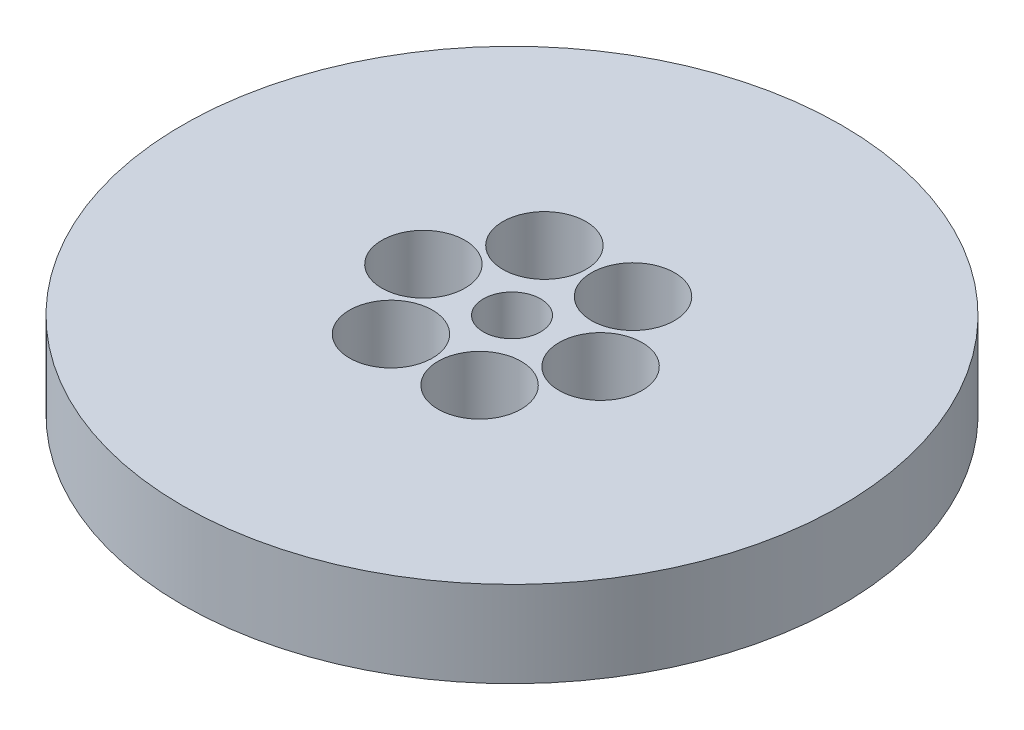
ISO-10303-21;
HEADER;
FILE_DESCRIPTION(('STEP AP214'),'2;1');
FILE_NAME('part.step','',(''),(''),'','','');
FILE_SCHEMA(('AUTOMOTIVE_DESIGN { 1 0 10303 214 1 1 1 1 }'));
ENDSEC;
DATA;
#1=APPLICATION_CONTEXT('core data for automotive mechanical design processes');
#2=APPLICATION_PROTOCOL_DEFINITION('international standard','automotive_design',2000,#1);
#3=PRODUCT_CONTEXT('',#1,'mechanical');
#4=PRODUCT('Part','Part','',(#3));
#5=PRODUCT_RELATED_PRODUCT_CATEGORY('part','',(#4));
#6=PRODUCT_DEFINITION_FORMATION('','',#4);
#7=PRODUCT_DEFINITION_CONTEXT('part definition',#1,'design');
#8=PRODUCT_DEFINITION('design','',#6,#7);
#9=PRODUCT_DEFINITION_SHAPE('','',#8);
#10=(LENGTH_UNIT() NAMED_UNIT(*) SI_UNIT(.MILLI.,.METRE.));
#11=(NAMED_UNIT(*) PLANE_ANGLE_UNIT() SI_UNIT($,.RADIAN.));
#12=(NAMED_UNIT(*) SI_UNIT($,.STERADIAN.) SOLID_ANGLE_UNIT());
#13=UNCERTAINTY_MEASURE_WITH_UNIT(LENGTH_MEASURE(1.E-05),#10,'distance_accuracy_value','');
#14=(GEOMETRIC_REPRESENTATION_CONTEXT(3) GLOBAL_UNCERTAINTY_ASSIGNED_CONTEXT((#13)) GLOBAL_UNIT_ASSIGNED_CONTEXT((#10,
#11,#12)) REPRESENTATION_CONTEXT('',''));
#15=CARTESIAN_POINT('',(0.,0.,0.));
#16=DIRECTION('',(0.,0.,1.));
#17=DIRECTION('',(1.,0.,0.));
#18=AXIS2_PLACEMENT_3D('',#15,#16,#17);
#19=CARTESIAN_POINT('',(0.,15.,0.));
#20=DIRECTION('',(0.,-1.,0.));
#21=DIRECTION('',(0.,0.,-1.));
#22=AXIS2_PLACEMENT_3D('',#19,#20,#21);
#23=CYLINDRICAL_SURFACE('',#22,57.5);
#24=CARTESIAN_POINT('',(0.,15.,0.));
#25=DIRECTION('',(0.,1.,0.));
#26=DIRECTION('',(0.,0.,1.));
#27=AXIS2_PLACEMENT_3D('',#24,#25,#26);
#28=CIRCLE('',#27,57.5);
#29=CARTESIAN_POINT('',(0.,15.,57.5));
#30=VERTEX_POINT('',#29);
#31=EDGE_CURVE('E10',#30,#30,#28,.T.);
#32=ORIENTED_EDGE('',*,*,#31,.F.);
#33=EDGE_LOOP('',(#32));
#34=FACE_BOUND('',#33,.T.);
#35=CARTESIAN_POINT('',(0.,0.,0.));
#36=DIRECTION('',(0.,1.,0.));
#37=DIRECTION('',(0.,0.,1.));
#38=AXIS2_PLACEMENT_3D('',#35,#36,#37);
#39=CIRCLE('',#38,57.5);
#40=CARTESIAN_POINT('',(0.,0.,57.5));
#41=VERTEX_POINT('',#40);
#42=EDGE_CURVE('E37',#41,#41,#39,.T.);
#43=ORIENTED_EDGE('',*,*,#42,.T.);
#44=EDGE_LOOP('',(#43));
#45=FACE_BOUND('',#44,.T.);
#46=ADVANCED_FACE('F40',(#34,#45),#23,.T.);
#47=CARTESIAN_POINT('',(0.,15.,0.));
#48=DIRECTION('',(0.,1.,0.));
#49=DIRECTION('',(0.,0.,1.));
#50=AXIS2_PLACEMENT_3D('',#47,#48,#49);
#51=PLANE('',#50);
#52=CARTESIAN_POINT('',(15.4574735331729,15.,0.));
#53=DIRECTION('',(0.,1.,0.));
#54=DIRECTION('',(0.,0.,-1.));
#55=AXIS2_PLACEMENT_3D('',#52,#53,#54);
#56=CIRCLE('',#55,7.24816447652533);
#57=CARTESIAN_POINT('',(15.4574735331729,15.,-7.24816447652533));
#58=VERTEX_POINT('',#57);
#59=EDGE_CURVE('E71',#58,#58,#56,.T.);
#60=ORIENTED_EDGE('',*,*,#59,.F.);
#61=EDGE_LOOP('',(#60));
#62=FACE_BOUND('',#61,.T.);
#63=CARTESIAN_POINT('',(7.72873676658653,15.,13.3865647580533));
#64=DIRECTION('',(0.,1.,0.));
#65=DIRECTION('',(0.866025403784436,0.,-0.500000000000004));
#66=AXIS2_PLACEMENT_3D('',#63,#64,#65);
#67=CIRCLE('',#66,7.24816447652533);
#68=CARTESIAN_POINT('',(14.0058313340654,15.,9.76248251979063));
#69=VERTEX_POINT('',#68);
#70=EDGE_CURVE('E70',#69,#69,#67,.T.);
#71=ORIENTED_EDGE('',*,*,#70,.F.);
#72=EDGE_LOOP('',(#71));
#73=FACE_BOUND('',#72,.T.);
#74=CARTESIAN_POINT('',(7.72873676658634,15.,-13.3865647580534));
#75=DIRECTION('',(0.,1.,0.));
#76=DIRECTION('',(-0.866025403784443,0.,-0.499999999999992));
#77=AXIS2_PLACEMENT_3D('',#74,#75,#76);
#78=CIRCLE('',#77,7.24816447652533);
#79=CARTESIAN_POINT('',(1.45164219910743,15.,-17.010646996316));
#80=VERTEX_POINT('',#79);
#81=EDGE_CURVE('E84',#80,#80,#78,.T.);
#82=ORIENTED_EDGE('',*,*,#81,.F.);
#83=EDGE_LOOP('',(#82));
#84=FACE_BOUND('',#83,.T.);
#85=CARTESIAN_POINT('',(-7.72873676658662,15.,-13.3865647580533));
#86=DIRECTION('',(0.,1.,0.));
#87=DIRECTION('',(-0.866025403784433,0.,0.50000000000001));
#88=AXIS2_PLACEMENT_3D('',#85,#86,#87);
#89=CIRCLE('',#88,7.24816447652533);
#90=CARTESIAN_POINT('',(-14.0058313340655,15.,-9.76248251979053));
#91=VERTEX_POINT('',#90);
#92=EDGE_CURVE('E78',#91,#91,#89,.T.);
#93=ORIENTED_EDGE('',*,*,#92,.F.);
#94=EDGE_LOOP('',(#93));
#95=FACE_BOUND('',#94,.T.);
#96=CARTESIAN_POINT('',(-7.72873676658644,15.,13.3865647580534));
#97=DIRECTION('',(0.,1.,0.));
#98=DIRECTION('',(0.86602540378444,0.,0.499999999999998));
#99=AXIS2_PLACEMENT_3D('',#96,#97,#98);
#100=CIRCLE('',#99,7.24816447652533);
#101=CARTESIAN_POINT('',(-1.45164219910755,15.,17.010646996316));
#102=VERTEX_POINT('',#101);
#103=EDGE_CURVE('E61',#102,#102,#100,.T.);
#104=ORIENTED_EDGE('',*,*,#103,.F.);
#105=EDGE_LOOP('',(#104));
#106=FACE_BOUND('',#105,.T.);
#107=CARTESIAN_POINT('',(-15.4574735331729,15.,0.));
#108=DIRECTION('',(0.,1.,0.));
#109=DIRECTION('',(0.,0.,1.));
#110=AXIS2_PLACEMENT_3D('',#107,#108,#109);
#111=CIRCLE('',#110,7.24816447652533);
#112=CARTESIAN_POINT('',(-15.4574735331729,15.,7.24816447652533));
#113=VERTEX_POINT('',#112);
#114=EDGE_CURVE('E54',#113,#113,#111,.T.);
#115=ORIENTED_EDGE('',*,*,#114,.F.);
#116=EDGE_LOOP('',(#115));
#117=FACE_BOUND('',#116,.T.);
#118=CARTESIAN_POINT('',(0.,15.,0.));
#119=DIRECTION('',(0.,1.,0.));
#120=DIRECTION('',(0.,0.,1.));
#121=AXIS2_PLACEMENT_3D('',#118,#119,#120);
#122=CIRCLE('',#121,5.);
#123=CARTESIAN_POINT('',(0.,15.,5.));
#124=VERTEX_POINT('',#123);
#125=EDGE_CURVE('E50',#124,#124,#122,.T.);
#126=ORIENTED_EDGE('',*,*,#125,.F.);
#127=EDGE_LOOP('',(#126));
#128=FACE_BOUND('',#127,.T.);
#129=ORIENTED_EDGE('',*,*,#31,.T.);
#130=EDGE_LOOP('',(#129));
#131=FACE_BOUND('',#130,.T.);
#132=ADVANCED_FACE('F99',(#62,#73,#84,#95,#106,#117,#128,#131),#51,.T.);
#133=CARTESIAN_POINT('',(0.,0.,0.));
#134=DIRECTION('',(0.,1.,0.));
#135=DIRECTION('',(0.,0.,1.));
#136=AXIS2_PLACEMENT_3D('',#133,#134,#135);
#137=PLANE('',#136);
#138=CARTESIAN_POINT('',(0.,0.,0.));
#139=DIRECTION('',(0.,1.,0.));
#140=DIRECTION('',(0.,0.,1.));
#141=AXIS2_PLACEMENT_3D('',#138,#139,#140);
#142=CIRCLE('',#141,5.);
#143=CARTESIAN_POINT('',(0.,0.,5.));
#144=VERTEX_POINT('',#143);
#145=EDGE_CURVE('E47',#144,#144,#142,.T.);
#146=ORIENTED_EDGE('',*,*,#145,.T.);
#147=EDGE_LOOP('',(#146));
#148=FACE_BOUND('',#147,.T.);
#149=ORIENTED_EDGE('',*,*,#42,.F.);
#150=EDGE_LOOP('',(#149));
#151=FACE_BOUND('',#150,.T.);
#152=ADVANCED_FACE('F103',(#148,#151),#137,.F.);
#153=CARTESIAN_POINT('',(0.,15.,0.));
#154=DIRECTION('',(0.,-1.,0.));
#155=DIRECTION('',(0.,0.,-1.));
#156=AXIS2_PLACEMENT_3D('',#153,#154,#155);
#157=CYLINDRICAL_SURFACE('',#156,5.);
#158=ORIENTED_EDGE('',*,*,#125,.T.);
#159=EDGE_LOOP('',(#158));
#160=FACE_BOUND('',#159,.T.);
#161=ORIENTED_EDGE('',*,*,#145,.F.);
#162=EDGE_LOOP('',(#161));
#163=FACE_BOUND('',#162,.T.);
#164=ADVANCED_FACE('F111',(#160,#163),#157,.F.);
#165=CARTESIAN_POINT('',(-15.4574735331729,0.736676254707263,0.));
#166=DIRECTION('',(0.,1.,0.));
#167=DIRECTION('',(0.,0.,1.));
#168=AXIS2_PLACEMENT_3D('',#165,#166,#167);
#169=CYLINDRICAL_SURFACE('',#168,7.24816447652533);
#170=CARTESIAN_POINT('',(-15.4574735331729,0.736676254707263,0.));
#171=DIRECTION('',(0.,1.,0.));
#172=DIRECTION('',(0.,0.,1.));
#173=AXIS2_PLACEMENT_3D('',#170,#171,#172);
#174=CIRCLE('',#173,7.24816447652533);
#175=CARTESIAN_POINT('',(-15.4574735331729,0.736676254707263,7.24816447652533));
#176=VERTEX_POINT('',#175);
#177=EDGE_CURVE('E55',#176,#176,#174,.T.);
#178=ORIENTED_EDGE('',*,*,#177,.F.);
#179=EDGE_LOOP('',(#178));
#180=FACE_BOUND('',#179,.T.);
#181=ORIENTED_EDGE('',*,*,#114,.T.);
#182=EDGE_LOOP('',(#181));
#183=FACE_BOUND('',#182,.T.);
#184=ADVANCED_FACE('F120',(#180,#183),#169,.F.);
#185=CARTESIAN_POINT('',(-15.4574735331729,0.736676254707263,0.));
#186=DIRECTION('',(0.,1.,0.));
#187=DIRECTION('',(0.,0.,1.));
#188=AXIS2_PLACEMENT_3D('',#185,#186,#187);
#189=PLANE('',#188);
#190=ORIENTED_EDGE('',*,*,#177,.T.);
#191=EDGE_LOOP('',(#190));
#192=FACE_BOUND('',#191,.T.);
#193=ADVANCED_FACE('F150',(#192),#189,.T.);
#194=CARTESIAN_POINT('',(-7.72873676658644,0.736676254707263,13.3865647580534));
#195=DIRECTION('',(0.,1.,0.));
#196=DIRECTION('',(0.,0.,1.));
#197=AXIS2_PLACEMENT_3D('',#194,#195,#196);
#198=CYLINDRICAL_SURFACE('',#197,7.24816447652533);
#199=CARTESIAN_POINT('',(-7.72873676658644,0.736676254707263,13.3865647580534));
#200=DIRECTION('',(0.,1.,0.));
#201=DIRECTION('',(0.86602540378444,0.,0.499999999999998));
#202=AXIS2_PLACEMENT_3D('',#199,#200,#201);
#203=CIRCLE('',#202,7.24816447652533);
#204=CARTESIAN_POINT('',(-1.45164219910755,0.736676254707263,17.010646996316));
#205=VERTEX_POINT('',#204);
#206=EDGE_CURVE('E59',#205,#205,#203,.T.);
#207=ORIENTED_EDGE('',*,*,#206,.F.);
#208=EDGE_LOOP('',(#207));
#209=FACE_BOUND('',#208,.T.);
#210=ORIENTED_EDGE('',*,*,#103,.T.);
#211=EDGE_LOOP('',(#210));
#212=FACE_BOUND('',#211,.T.);
#213=ADVANCED_FACE('F154',(#209,#212),#198,.F.);
#214=CARTESIAN_POINT('',(-7.72873676658644,0.736676254707263,13.3865647580534));
#215=DIRECTION('',(0.,1.,0.));
#216=DIRECTION('',(0.86602540378444,0.,0.499999999999998));
#217=AXIS2_PLACEMENT_3D('',#214,#215,#216);
#218=PLANE('',#217);
#219=ORIENTED_EDGE('',*,*,#206,.T.);
#220=EDGE_LOOP('',(#219));
#221=FACE_BOUND('',#220,.T.);
#222=ADVANCED_FACE('F166',(#221),#218,.T.);
#223=CARTESIAN_POINT('',(-7.72873676658662,0.736676254707263,-13.3865647580533));
#224=DIRECTION('',(0.,1.,0.));
#225=DIRECTION('',(0.,0.,1.));
#226=AXIS2_PLACEMENT_3D('',#223,#224,#225);
#227=CYLINDRICAL_SURFACE('',#226,7.24816447652533);
#228=CARTESIAN_POINT('',(-7.72873676658662,0.736676254707263,-13.3865647580533));
#229=DIRECTION('',(0.,1.,0.));
#230=DIRECTION('',(-0.866025403784433,0.,0.50000000000001));
#231=AXIS2_PLACEMENT_3D('',#228,#229,#230);
#232=CIRCLE('',#231,7.24816447652533);
#233=CARTESIAN_POINT('',(-14.0058313340655,0.736676254707263,-9.76248251979053));
#234=VERTEX_POINT('',#233);
#235=EDGE_CURVE('E85',#234,#234,#232,.T.);
#236=ORIENTED_EDGE('',*,*,#235,.F.);
#237=EDGE_LOOP('',(#236));
#238=FACE_BOUND('',#237,.T.);
#239=ORIENTED_EDGE('',*,*,#92,.T.);
#240=EDGE_LOOP('',(#239));
#241=FACE_BOUND('',#240,.T.);
#242=ADVANCED_FACE('F177',(#238,#241),#227,.F.);
#243=CARTESIAN_POINT('',(-7.72873676658662,0.736676254707263,-13.3865647580533));
#244=DIRECTION('',(0.,1.,0.));
#245=DIRECTION('',(-0.866025403784433,0.,0.50000000000001));
#246=AXIS2_PLACEMENT_3D('',#243,#244,#245);
#247=PLANE('',#246);
#248=ORIENTED_EDGE('',*,*,#235,.T.);
#249=EDGE_LOOP('',(#248));
#250=FACE_BOUND('',#249,.T.);
#251=ADVANCED_FACE('F96',(#250),#247,.T.);
#252=CARTESIAN_POINT('',(7.72873676658634,0.736676254707263,-13.3865647580534));
#253=DIRECTION('',(0.,1.,0.));
#254=DIRECTION('',(0.,0.,1.));
#255=AXIS2_PLACEMENT_3D('',#252,#253,#254);
#256=CYLINDRICAL_SURFACE('',#255,7.24816447652533);
#257=CARTESIAN_POINT('',(7.72873676658634,0.736676254707263,-13.3865647580534));
#258=DIRECTION('',(0.,1.,0.));
#259=DIRECTION('',(-0.866025403784443,0.,-0.499999999999992));
#260=AXIS2_PLACEMENT_3D('',#257,#258,#259);
#261=CIRCLE('',#260,7.24816447652533);
#262=CARTESIAN_POINT('',(1.45164219910743,0.736676254707263,-17.010646996316));
#263=VERTEX_POINT('',#262);
#264=EDGE_CURVE('E76',#263,#263,#261,.T.);
#265=ORIENTED_EDGE('',*,*,#264,.F.);
#266=EDGE_LOOP('',(#265));
#267=FACE_BOUND('',#266,.T.);
#268=ORIENTED_EDGE('',*,*,#81,.T.);
#269=EDGE_LOOP('',(#268));
#270=FACE_BOUND('',#269,.T.);
#271=ADVANCED_FACE('F91',(#267,#270),#256,.F.);
#272=CARTESIAN_POINT('',(7.72873676658634,0.736676254707263,-13.3865647580534));
#273=DIRECTION('',(0.,1.,0.));
#274=DIRECTION('',(-0.866025403784443,0.,-0.499999999999992));
#275=AXIS2_PLACEMENT_3D('',#272,#273,#274);
#276=PLANE('',#275);
#277=ORIENTED_EDGE('',*,*,#264,.T.);
#278=EDGE_LOOP('',(#277));
#279=FACE_BOUND('',#278,.T.);
#280=ADVANCED_FACE('F93',(#279),#276,.T.);
#281=CARTESIAN_POINT('',(7.72873676658653,0.736676254707263,13.3865647580533));
#282=DIRECTION('',(0.,1.,0.));
#283=DIRECTION('',(0.,0.,1.));
#284=AXIS2_PLACEMENT_3D('',#281,#282,#283);
#285=CYLINDRICAL_SURFACE('',#284,7.24816447652533);
#286=CARTESIAN_POINT('',(7.72873676658653,0.736676254707263,13.3865647580533));
#287=DIRECTION('',(0.,1.,0.));
#288=DIRECTION('',(0.866025403784436,0.,-0.500000000000004));
#289=AXIS2_PLACEMENT_3D('',#286,#287,#288);
#290=CIRCLE('',#289,7.24816447652533);
#291=CARTESIAN_POINT('',(14.0058313340654,0.736676254707263,9.76248251979063));
#292=VERTEX_POINT('',#291);
#293=EDGE_CURVE('E63',#292,#292,#290,.T.);
#294=ORIENTED_EDGE('',*,*,#293,.F.);
#295=EDGE_LOOP('',(#294));
#296=FACE_BOUND('',#295,.T.);
#297=ORIENTED_EDGE('',*,*,#70,.T.);
#298=EDGE_LOOP('',(#297));
#299=FACE_BOUND('',#298,.T.);
#300=ADVANCED_FACE('F208',(#296,#299),#285,.F.);
#301=CARTESIAN_POINT('',(7.72873676658653,0.736676254707263,13.3865647580533));
#302=DIRECTION('',(0.,1.,0.));
#303=DIRECTION('',(0.866025403784436,0.,-0.500000000000004));
#304=AXIS2_PLACEMENT_3D('',#301,#302,#303);
#305=PLANE('',#304);
#306=ORIENTED_EDGE('',*,*,#293,.T.);
#307=EDGE_LOOP('',(#306));
#308=FACE_BOUND('',#307,.T.);
#309=ADVANCED_FACE('F216',(#308),#305,.T.);
#310=CARTESIAN_POINT('',(15.4574735331729,0.736676254707263,0.));
#311=DIRECTION('',(0.,1.,0.));
#312=DIRECTION('',(0.,0.,1.));
#313=AXIS2_PLACEMENT_3D('',#310,#311,#312);
#314=CYLINDRICAL_SURFACE('',#313,7.24816447652533);
#315=CARTESIAN_POINT('',(15.4574735331729,0.736676254707263,0.));
#316=DIRECTION('',(0.,1.,0.));
#317=DIRECTION('',(0.,0.,-1.));
#318=AXIS2_PLACEMENT_3D('',#315,#316,#317);
#319=CIRCLE('',#318,7.24816447652533);
#320=CARTESIAN_POINT('',(15.4574735331729,0.736676254707263,-7.24816447652533));
#321=VERTEX_POINT('',#320);
#322=EDGE_CURVE('E69',#321,#321,#319,.T.);
#323=ORIENTED_EDGE('',*,*,#322,.F.);
#324=EDGE_LOOP('',(#323));
#325=FACE_BOUND('',#324,.T.);
#326=ORIENTED_EDGE('',*,*,#59,.T.);
#327=EDGE_LOOP('',(#326));
#328=FACE_BOUND('',#327,.T.);
#329=ADVANCED_FACE('F223',(#325,#328),#314,.F.);
#330=CARTESIAN_POINT('',(15.4574735331729,0.736676254707263,0.));
#331=DIRECTION('',(0.,1.,0.));
#332=DIRECTION('',(0.,0.,-1.));
#333=AXIS2_PLACEMENT_3D('',#330,#331,#332);
#334=PLANE('',#333);
#335=ORIENTED_EDGE('',*,*,#322,.T.);
#336=EDGE_LOOP('',(#335));
#337=FACE_BOUND('',#336,.T.);
#338=ADVANCED_FACE('F233',(#337),#334,.T.);
#339=CLOSED_SHELL('',(#46,#132,#152,#164,#184,#193,#213,#222,#242,#251,#271,#280,#300,#309,#329,#338));
#340=MANIFOLD_SOLID_BREP('B2',#339);
#341=ADVANCED_BREP_SHAPE_REPRESENTATION('',(#18,#340),#14);
#342=SHAPE_DEFINITION_REPRESENTATION(#9,#341);
ENDSEC;
END-ISO-10303-21;
